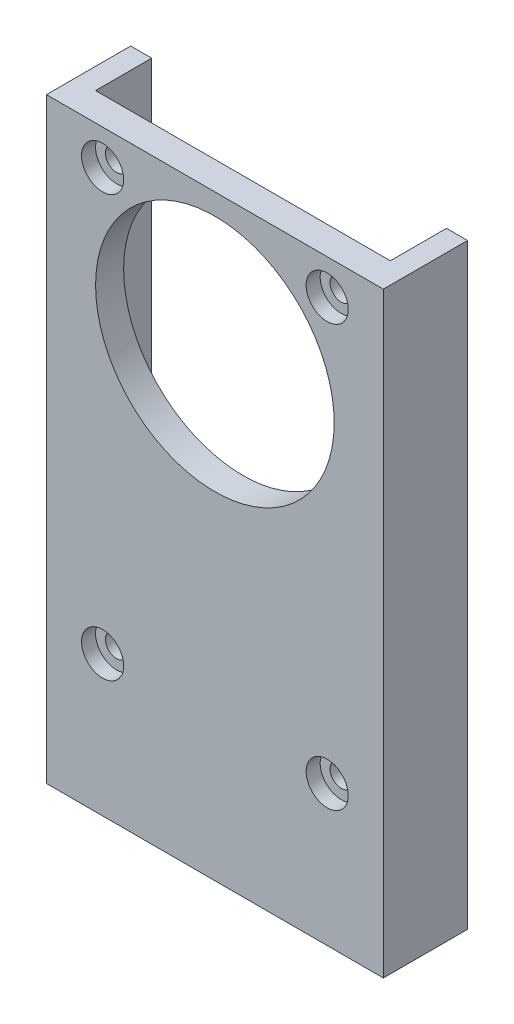
ISO-10303-21;
HEADER;
FILE_DESCRIPTION(('STEP AP214'),'2;1');
FILE_NAME('part.step','',(''),(''),'','','');
FILE_SCHEMA(('AUTOMOTIVE_DESIGN { 1 0 10303 214 1 1 1 1 }'));
ENDSEC;
DATA;
#1=APPLICATION_CONTEXT('core data for automotive mechanical design processes');
#2=APPLICATION_PROTOCOL_DEFINITION('international standard','automotive_design',2000,#1);
#3=PRODUCT_CONTEXT('',#1,'mechanical');
#4=PRODUCT('Part','Part','',(#3));
#5=PRODUCT_RELATED_PRODUCT_CATEGORY('part','',(#4));
#6=PRODUCT_DEFINITION_FORMATION('','',#4);
#7=PRODUCT_DEFINITION_CONTEXT('part definition',#1,'design');
#8=PRODUCT_DEFINITION('design','',#6,#7);
#9=PRODUCT_DEFINITION_SHAPE('','',#8);
#10=(LENGTH_UNIT() NAMED_UNIT(*) SI_UNIT(.MILLI.,.METRE.));
#11=(NAMED_UNIT(*) PLANE_ANGLE_UNIT() SI_UNIT($,.RADIAN.));
#12=(NAMED_UNIT(*) SI_UNIT($,.STERADIAN.) SOLID_ANGLE_UNIT());
#13=UNCERTAINTY_MEASURE_WITH_UNIT(LENGTH_MEASURE(1.E-05),#10,'distance_accuracy_value','');
#14=(GEOMETRIC_REPRESENTATION_CONTEXT(3) GLOBAL_UNCERTAINTY_ASSIGNED_CONTEXT((#13)) GLOBAL_UNIT_ASSIGNED_CONTEXT((#10,
#11,#12)) REPRESENTATION_CONTEXT('',''));
#15=CARTESIAN_POINT('',(0.,0.,0.));
#16=DIRECTION('',(0.,0.,1.));
#17=DIRECTION('',(1.,0.,0.));
#18=AXIS2_PLACEMENT_3D('',#15,#16,#17);
#19=CARTESIAN_POINT('',(8.00000000000002,-15.,2.));
#20=DIRECTION('',(0.,0.,-1.));
#21=DIRECTION('',(-1.,0.,0.));
#22=AXIS2_PLACEMENT_3D('',#19,#20,#21);
#23=CYLINDRICAL_SURFACE('',#22,0.800000000000001);
#24=CARTESIAN_POINT('',(8.00000000000002,-15.,0.));
#25=DIRECTION('',(0.,0.,1.));
#26=DIRECTION('',(1.,0.,0.));
#27=AXIS2_PLACEMENT_3D('',#24,#25,#26);
#28=CIRCLE('',#27,0.800000000000001);
#29=CARTESIAN_POINT('',(8.80000000000002,-15.,0.));
#30=VERTEX_POINT('',#29);
#31=EDGE_CURVE('E391',#30,#30,#28,.T.);
#32=ORIENTED_EDGE('',*,*,#31,.F.);
#33=EDGE_LOOP('',(#32));
#34=FACE_BOUND('',#33,.T.);
#35=CARTESIAN_POINT('',(8.00000000000002,-15.,1.));
#36=DIRECTION('',(0.,0.,1.));
#37=DIRECTION('',(1.,0.,0.));
#38=AXIS2_PLACEMENT_3D('',#35,#36,#37);
#39=CIRCLE('',#38,0.800000000000001);
#40=CARTESIAN_POINT('',(8.80000000000002,-15.,1.));
#41=VERTEX_POINT('',#40);
#42=EDGE_CURVE('E51',#41,#41,#39,.T.);
#43=ORIENTED_EDGE('',*,*,#42,.T.);
#44=EDGE_LOOP('',(#43));
#45=FACE_BOUND('',#44,.T.);
#46=ADVANCED_FACE('F47',(#34,#45),#23,.F.);
#47=CARTESIAN_POINT('',(8.00000000000001,15.,2.));
#48=DIRECTION('',(0.,0.,-1.));
#49=DIRECTION('',(-1.,0.,0.));
#50=AXIS2_PLACEMENT_3D('',#47,#48,#49);
#51=CYLINDRICAL_SURFACE('',#50,0.800000000000001);
#52=CARTESIAN_POINT('',(8.00000000000001,15.,0.));
#53=DIRECTION('',(0.,0.,1.));
#54=DIRECTION('',(1.,0.,0.));
#55=AXIS2_PLACEMENT_3D('',#52,#53,#54);
#56=CIRCLE('',#55,0.800000000000001);
#57=CARTESIAN_POINT('',(8.80000000000001,15.,0.));
#58=VERTEX_POINT('',#57);
#59=EDGE_CURVE('E372',#58,#58,#56,.F.);
#60=ORIENTED_EDGE('',*,*,#59,.T.);
#61=EDGE_LOOP('',(#60));
#62=FACE_BOUND('',#61,.T.);
#63=CARTESIAN_POINT('',(8.00000000000001,15.,1.));
#64=DIRECTION('',(0.,0.,1.));
#65=DIRECTION('',(1.,0.,0.));
#66=AXIS2_PLACEMENT_3D('',#63,#64,#65);
#67=CIRCLE('',#66,0.800000000000001);
#68=CARTESIAN_POINT('',(8.80000000000001,15.,1.));
#69=VERTEX_POINT('',#68);
#70=EDGE_CURVE('E402',#69,#69,#67,.F.);
#71=ORIENTED_EDGE('',*,*,#70,.F.);
#72=EDGE_LOOP('',(#71));
#73=FACE_BOUND('',#72,.T.);
#74=ADVANCED_FACE('F510',(#62,#73),#51,.F.);
#75=CARTESIAN_POINT('',(0.,-25.,-2.75));
#76=DIRECTION('',(0.,1.,0.));
#77=DIRECTION('',(0.,0.,1.));
#78=AXIS2_PLACEMENT_3D('',#75,#76,#77);
#79=CYLINDRICAL_SURFACE('',#78,1.);
#80=CARTESIAN_POINT('',(0.,-25.,-2.75));
#81=DIRECTION('',(0.,1.,0.));
#82=DIRECTION('',(0.,0.,1.));
#83=AXIS2_PLACEMENT_3D('',#80,#81,#82);
#84=CIRCLE('',#83,1.);
#85=CARTESIAN_POINT('',(0.,-25.,-1.75));
#86=VERTEX_POINT('',#85);
#87=EDGE_CURVE('E302',#86,#86,#84,.T.);
#88=ORIENTED_EDGE('',*,*,#87,.F.);
#89=EDGE_LOOP('',(#88));
#90=FACE_BOUND('',#89,.T.);
#91=CARTESIAN_POINT('',(0.,-24.,-2.75));
#92=DIRECTION('',(0.,1.,0.));
#93=DIRECTION('',(0.,0.,1.));
#94=AXIS2_PLACEMENT_3D('',#91,#92,#93);
#95=CIRCLE('',#94,1.);
#96=CARTESIAN_POINT('',(0.,-24.,-1.75));
#97=VERTEX_POINT('',#96);
#98=EDGE_CURVE('E248',#97,#97,#95,.T.);
#99=ORIENTED_EDGE('',*,*,#98,.T.);
#100=EDGE_LOOP('',(#99));
#101=FACE_BOUND('',#100,.T.);
#102=ADVANCED_FACE('F517',(#90,#101),#79,.F.);
#103=CARTESIAN_POINT('',(0.,0.,0.));
#104=DIRECTION('',(0.,0.,1.));
#105=DIRECTION('',(1.,0.,0.));
#106=AXIS2_PLACEMENT_3D('',#103,#104,#105);
#107=PLANE('',#106);
#108=CARTESIAN_POINT('',(-8.,-15.,0.));
#109=DIRECTION('',(0.,0.,1.));
#110=DIRECTION('',(1.,0.,0.));
#111=AXIS2_PLACEMENT_3D('',#108,#109,#110);
#112=CIRCLE('',#111,0.800000000000001);
#113=CARTESIAN_POINT('',(-7.2,-15.,0.));
#114=VERTEX_POINT('',#113);
#115=EDGE_CURVE('E366',#114,#114,#112,.F.);
#116=ORIENTED_EDGE('',*,*,#115,.F.);
#117=EDGE_LOOP('',(#116));
#118=FACE_BOUND('',#117,.T.);
#119=ORIENTED_EDGE('',*,*,#31,.T.);
#120=EDGE_LOOP('',(#119));
#121=FACE_BOUND('',#120,.T.);
#122=CARTESIAN_POINT('',(-8.,15.,0.));
#123=DIRECTION('',(0.,0.,1.));
#124=DIRECTION('',(1.,0.,0.));
#125=AXIS2_PLACEMENT_3D('',#122,#123,#124);
#126=CIRCLE('',#125,0.800000000000001);
#127=CARTESIAN_POINT('',(-7.2,15.,0.));
#128=VERTEX_POINT('',#127);
#129=EDGE_CURVE('E376',#128,#128,#126,.T.);
#130=ORIENTED_EDGE('',*,*,#129,.T.);
#131=EDGE_LOOP('',(#130));
#132=FACE_BOUND('',#131,.T.);
#133=ORIENTED_EDGE('',*,*,#59,.F.);
#134=EDGE_LOOP('',(#133));
#135=FACE_BOUND('',#134,.T.);
#136=CARTESIAN_POINT('',(0.,7.5,0.));
#137=DIRECTION('',(0.,0.,1.));
#138=DIRECTION('',(1.,0.,0.));
#139=AXIS2_PLACEMENT_3D('',#136,#137,#138);
#140=CIRCLE('',#139,8.5);
#141=CARTESIAN_POINT('',(8.5,7.5,0.));
#142=VERTEX_POINT('',#141);
#143=EDGE_CURVE('E361',#142,#142,#140,.T.);
#144=ORIENTED_EDGE('',*,*,#143,.T.);
#145=EDGE_LOOP('',(#144));
#146=FACE_BOUND('',#145,.T.);
#147=DIRECTION('',(0.,1.,0.));
#148=VECTOR('',#147,1.);
#149=CARTESIAN_POINT('',(-5.00000000000002,0.,0.));
#150=LINE('',#149,#148);
#151=CARTESIAN_POINT('',(-5.,-25.,0.));
#152=VERTEX_POINT('',#151);
#153=CARTESIAN_POINT('',(-5.,-23.,0.));
#154=VERTEX_POINT('',#153);
#155=EDGE_CURVE('E350',#152,#154,#150,.T.);
#156=ORIENTED_EDGE('',*,*,#155,.F.);
#157=DIRECTION('',(-1.,0.,0.));
#158=VECTOR('',#157,1.);
#159=CARTESIAN_POINT('',(0.,-25.,0.));
#160=LINE('',#159,#158);
#161=CARTESIAN_POINT('',(-10.5,-25.,0.));
#162=VERTEX_POINT('',#161);
#163=EDGE_CURVE('E356',#152,#162,#160,.T.);
#164=ORIENTED_EDGE('',*,*,#163,.T.);
#165=DIRECTION('',(0.,1.,0.));
#166=VECTOR('',#165,1.);
#167=CARTESIAN_POINT('',(-10.5,0.,0.));
#168=LINE('',#167,#166);
#169=CARTESIAN_POINT('',(-10.5,17.5,0.));
#170=VERTEX_POINT('',#169);
#171=EDGE_CURVE('E387',#162,#170,#168,.T.);
#172=ORIENTED_EDGE('',*,*,#171,.T.);
#173=DIRECTION('',(1.,0.,0.));
#174=VECTOR('',#173,1.);
#175=CARTESIAN_POINT('',(0.,17.5,0.));
#176=LINE('',#175,#174);
#177=CARTESIAN_POINT('',(10.5,17.5,0.));
#178=VERTEX_POINT('',#177);
#179=EDGE_CURVE('E384',#170,#178,#176,.T.);
#180=ORIENTED_EDGE('',*,*,#179,.T.);
#181=DIRECTION('',(0.,1.,0.));
#182=VECTOR('',#181,1.);
#183=CARTESIAN_POINT('',(10.5,0.,0.));
#184=LINE('',#183,#182);
#185=CARTESIAN_POINT('',(10.5,-25.,0.));
#186=VERTEX_POINT('',#185);
#187=EDGE_CURVE('E380',#186,#178,#184,.T.);
#188=ORIENTED_EDGE('',*,*,#187,.F.);
#189=CARTESIAN_POINT('',(5.,-25.,0.));
#190=VERTEX_POINT('',#189);
#191=EDGE_CURVE('E357',#186,#190,#160,.T.);
#192=ORIENTED_EDGE('',*,*,#191,.T.);
#193=DIRECTION('',(0.,1.,0.));
#194=VECTOR('',#193,1.);
#195=CARTESIAN_POINT('',(5.,0.,0.));
#196=LINE('',#195,#194);
#197=CARTESIAN_POINT('',(5.,-23.,0.));
#198=VERTEX_POINT('',#197);
#199=EDGE_CURVE('E337',#190,#198,#196,.T.);
#200=ORIENTED_EDGE('',*,*,#199,.T.);
#201=DIRECTION('',(1.,0.,0.));
#202=VECTOR('',#201,1.);
#203=CARTESIAN_POINT('',(0.,-23.,0.));
#204=LINE('',#203,#202);
#205=EDGE_CURVE('E11',#154,#198,#204,.T.);
#206=ORIENTED_EDGE('',*,*,#205,.F.);
#207=EDGE_LOOP('',(#156,#164,#172,#180,#188,#192,#200,#206));
#208=FACE_BOUND('',#207,.T.);
#209=ADVANCED_FACE('F484',(#118,#121,#132,#135,#146,#208),#107,.F.);
#210=CARTESIAN_POINT('',(0.,17.5,2.));
#211=DIRECTION('',(0.,1.,0.));
#212=DIRECTION('',(0.,0.,1.));
#213=AXIS2_PLACEMENT_3D('',#210,#211,#212);
#214=PLANE('',#213);
#215=ORIENTED_EDGE('',*,*,#179,.F.);
#216=DIRECTION('',(0.,0.,1.));
#217=VECTOR('',#216,1.);
#218=CARTESIAN_POINT('',(-10.5,17.5,0.));
#219=LINE('',#218,#217);
#220=CARTESIAN_POINT('',(-10.5,17.5,-4.));
#221=VERTEX_POINT('',#220);
#222=EDGE_CURVE('E221',#221,#170,#219,.T.);
#223=ORIENTED_EDGE('',*,*,#222,.F.);
#224=DIRECTION('',(1.,0.,0.));
#225=VECTOR('',#224,1.);
#226=CARTESIAN_POINT('',(0.,17.5,-4.));
#227=LINE('',#226,#225);
#228=CARTESIAN_POINT('',(-12.,17.5,-4.));
#229=VERTEX_POINT('',#228);
#230=EDGE_CURVE('E222',#229,#221,#227,.T.);
#231=ORIENTED_EDGE('',*,*,#230,.F.);
#232=DIRECTION('',(0.,0.,1.));
#233=VECTOR('',#232,1.);
#234=CARTESIAN_POINT('',(-12.,17.5,0.));
#235=LINE('',#234,#233);
#236=CARTESIAN_POINT('',(-12.,17.5,2.));
#237=VERTEX_POINT('',#236);
#238=EDGE_CURVE('E216',#229,#237,#235,.T.);
#239=ORIENTED_EDGE('',*,*,#238,.T.);
#240=DIRECTION('',(1.,0.,0.));
#241=VECTOR('',#240,1.);
#242=CARTESIAN_POINT('',(0.,17.5,2.));
#243=LINE('',#242,#241);
#244=CARTESIAN_POINT('',(12.,17.5,2.));
#245=VERTEX_POINT('',#244);
#246=EDGE_CURVE('E57',#237,#245,#243,.T.);
#247=ORIENTED_EDGE('',*,*,#246,.T.);
#248=DIRECTION('',(0.,0.,1.));
#249=VECTOR('',#248,1.);
#250=CARTESIAN_POINT('',(12.,17.5,0.));
#251=LINE('',#250,#249);
#252=CARTESIAN_POINT('',(12.,17.5,-4.));
#253=VERTEX_POINT('',#252);
#254=EDGE_CURVE('E186',#253,#245,#251,.T.);
#255=ORIENTED_EDGE('',*,*,#254,.F.);
#256=DIRECTION('',(-1.,0.,0.));
#257=VECTOR('',#256,1.);
#258=CARTESIAN_POINT('',(0.,17.5,-4.));
#259=LINE('',#258,#257);
#260=CARTESIAN_POINT('',(10.5,17.5,-4.));
#261=VERTEX_POINT('',#260);
#262=EDGE_CURVE('E181',#253,#261,#259,.T.);
#263=ORIENTED_EDGE('',*,*,#262,.T.);
#264=DIRECTION('',(0.,0.,1.));
#265=VECTOR('',#264,1.);
#266=CARTESIAN_POINT('',(10.5,17.5,0.));
#267=LINE('',#266,#265);
#268=EDGE_CURVE('E198',#261,#178,#267,.T.);
#269=ORIENTED_EDGE('',*,*,#268,.T.);
#270=EDGE_LOOP('',(#215,#223,#231,#239,#247,#255,#263,#269));
#271=FACE_BOUND('',#270,.T.);
#272=ADVANCED_FACE('F463',(#271),#214,.T.);
#273=CARTESIAN_POINT('',(-8.,15.,2.));
#274=DIRECTION('',(0.,0.,-1.));
#275=DIRECTION('',(-1.,0.,0.));
#276=AXIS2_PLACEMENT_3D('',#273,#274,#275);
#277=CYLINDRICAL_SURFACE('',#276,0.800000000000001);
#278=CARTESIAN_POINT('',(-8.,15.,1.));
#279=DIRECTION('',(0.,0.,-1.));
#280=DIRECTION('',(-1.,0.,0.));
#281=AXIS2_PLACEMENT_3D('',#278,#279,#280);
#282=CIRCLE('',#281,0.800000000000001);
#283=CARTESIAN_POINT('',(-8.8,15.,1.));
#284=VERTEX_POINT('',#283);
#285=EDGE_CURVE('E406',#284,#284,#282,.T.);
#286=ORIENTED_EDGE('',*,*,#285,.F.);
#287=EDGE_LOOP('',(#286));
#288=FACE_BOUND('',#287,.T.);
#289=ORIENTED_EDGE('',*,*,#129,.F.);
#290=EDGE_LOOP('',(#289));
#291=FACE_BOUND('',#290,.T.);
#292=ADVANCED_FACE('F526',(#288,#291),#277,.F.);
#293=CARTESIAN_POINT('',(0.,7.5,2.));
#294=DIRECTION('',(0.,0.,-1.));
#295=DIRECTION('',(-1.,0.,0.));
#296=AXIS2_PLACEMENT_3D('',#293,#294,#295);
#297=CYLINDRICAL_SURFACE('',#296,8.5);
#298=CARTESIAN_POINT('',(0.,7.5,2.));
#299=DIRECTION('',(0.,0.,1.));
#300=DIRECTION('',(1.,0.,0.));
#301=AXIS2_PLACEMENT_3D('',#298,#299,#300);
#302=CIRCLE('',#301,8.5);
#303=CARTESIAN_POINT('',(8.5,7.5,2.));
#304=VERTEX_POINT('',#303);
#305=EDGE_CURVE('E362',#304,#304,#302,.T.);
#306=ORIENTED_EDGE('',*,*,#305,.T.);
#307=EDGE_LOOP('',(#306));
#308=FACE_BOUND('',#307,.T.);
#309=ORIENTED_EDGE('',*,*,#143,.F.);
#310=EDGE_LOOP('',(#309));
#311=FACE_BOUND('',#310,.T.);
#312=ADVANCED_FACE('F49',(#308,#311),#297,.F.);
#313=CARTESIAN_POINT('',(-8.,-15.,2.));
#314=DIRECTION('',(0.,0.,-1.));
#315=DIRECTION('',(-1.,0.,0.));
#316=AXIS2_PLACEMENT_3D('',#313,#314,#315);
#317=CYLINDRICAL_SURFACE('',#316,0.800000000000001);
#318=CARTESIAN_POINT('',(-8.,-15.,1.));
#319=DIRECTION('',(0.,0.,-1.));
#320=DIRECTION('',(-1.,0.,0.));
#321=AXIS2_PLACEMENT_3D('',#318,#319,#320);
#322=CIRCLE('',#321,0.800000000000001);
#323=CARTESIAN_POINT('',(-8.8,-15.,1.));
#324=VERTEX_POINT('',#323);
#325=EDGE_CURVE('E398',#324,#324,#322,.F.);
#326=ORIENTED_EDGE('',*,*,#325,.T.);
#327=EDGE_LOOP('',(#326));
#328=FACE_BOUND('',#327,.T.);
#329=ORIENTED_EDGE('',*,*,#115,.T.);
#330=EDGE_LOOP('',(#329));
#331=FACE_BOUND('',#330,.T.);
#332=ADVANCED_FACE('F522',(#328,#331),#317,.F.);
#333=CARTESIAN_POINT('',(0.,0.,2.));
#334=DIRECTION('',(0.,0.,1.));
#335=DIRECTION('',(1.,0.,0.));
#336=AXIS2_PLACEMENT_3D('',#333,#334,#335);
#337=PLANE('',#336);
#338=CARTESIAN_POINT('',(-8.00000000000001,15.,2.));
#339=DIRECTION('',(0.,0.,1.));
#340=DIRECTION('',(-1.,0.,0.));
#341=AXIS2_PLACEMENT_3D('',#338,#339,#340);
#342=CIRCLE('',#341,1.5);
#343=CARTESIAN_POINT('',(-9.50000000000001,15.,2.));
#344=VERTEX_POINT('',#343);
#345=EDGE_CURVE('E442',#344,#344,#342,.T.);
#346=ORIENTED_EDGE('',*,*,#345,.F.);
#347=EDGE_LOOP('',(#346));
#348=FACE_BOUND('',#347,.T.);
#349=CARTESIAN_POINT('',(-8.00000000000002,-15.,2.));
#350=DIRECTION('',(0.,0.,1.));
#351=DIRECTION('',(-1.,0.,0.));
#352=AXIS2_PLACEMENT_3D('',#349,#350,#351);
#353=CIRCLE('',#352,1.5);
#354=CARTESIAN_POINT('',(-9.50000000000002,-15.,2.));
#355=VERTEX_POINT('',#354);
#356=EDGE_CURVE('E428',#355,#355,#353,.T.);
#357=ORIENTED_EDGE('',*,*,#356,.F.);
#358=EDGE_LOOP('',(#357));
#359=FACE_BOUND('',#358,.T.);
#360=CARTESIAN_POINT('',(8.00000000000002,-15.,2.));
#361=DIRECTION('',(0.,0.,1.));
#362=DIRECTION('',(1.,0.,0.));
#363=AXIS2_PLACEMENT_3D('',#360,#361,#362);
#364=CIRCLE('',#363,1.5);
#365=CARTESIAN_POINT('',(9.50000000000002,-15.,2.));
#366=VERTEX_POINT('',#365);
#367=EDGE_CURVE('E427',#366,#366,#364,.T.);
#368=ORIENTED_EDGE('',*,*,#367,.F.);
#369=EDGE_LOOP('',(#368));
#370=FACE_BOUND('',#369,.T.);
#371=CARTESIAN_POINT('',(8.00000000000001,15.,2.));
#372=DIRECTION('',(0.,0.,1.));
#373=DIRECTION('',(1.,0.,0.));
#374=AXIS2_PLACEMENT_3D('',#371,#372,#373);
#375=CIRCLE('',#374,1.5);
#376=CARTESIAN_POINT('',(9.50000000000001,15.,2.));
#377=VERTEX_POINT('',#376);
#378=EDGE_CURVE('E433',#377,#377,#375,.T.);
#379=ORIENTED_EDGE('',*,*,#378,.F.);
#380=EDGE_LOOP('',(#379));
#381=FACE_BOUND('',#380,.T.);
#382=DIRECTION('',(1.,0.,0.));
#383=VECTOR('',#382,1.);
#384=CARTESIAN_POINT('',(0.,-25.,2.));
#385=LINE('',#384,#383);
#386=CARTESIAN_POINT('',(-12.,-25.,2.));
#387=VERTEX_POINT('',#386);
#388=CARTESIAN_POINT('',(12.,-25.,2.));
#389=VERTEX_POINT('',#388);
#390=EDGE_CURVE('E353',#387,#389,#385,.T.);
#391=ORIENTED_EDGE('',*,*,#390,.T.);
#392=DIRECTION('',(0.,1.,0.));
#393=VECTOR('',#392,1.);
#394=CARTESIAN_POINT('',(12.,-31.1846584384265,2.));
#395=LINE('',#394,#393);
#396=EDGE_CURVE('E194',#389,#245,#395,.T.);
#397=ORIENTED_EDGE('',*,*,#396,.T.);
#398=ORIENTED_EDGE('',*,*,#246,.F.);
#399=DIRECTION('',(0.,1.,0.));
#400=VECTOR('',#399,1.);
#401=CARTESIAN_POINT('',(-12.,-31.1846584384265,2.));
#402=LINE('',#401,#400);
#403=EDGE_CURVE('E237',#387,#237,#402,.T.);
#404=ORIENTED_EDGE('',*,*,#403,.F.);
#405=EDGE_LOOP('',(#391,#397,#398,#404));
#406=FACE_BOUND('',#405,.T.);
#407=ORIENTED_EDGE('',*,*,#305,.F.);
#408=EDGE_LOOP('',(#407));
#409=FACE_BOUND('',#408,.T.);
#410=ADVANCED_FACE('F468',(#348,#359,#370,#381,#406,#409),#337,.T.);
#411=CARTESIAN_POINT('',(0.,-25.,-22.2991031209778));
#412=DIRECTION('',(0.,-1.,0.));
#413=DIRECTION('',(1.,0.,0.));
#414=AXIS2_PLACEMENT_3D('',#411,#412,#413);
#415=PLANE('',#414);
#416=ORIENTED_EDGE('',*,*,#87,.T.);
#417=EDGE_LOOP('',(#416));
#418=FACE_BOUND('',#417,.T.);
#419=ORIENTED_EDGE('',*,*,#191,.F.);
#420=DIRECTION('',(0.,0.,1.));
#421=VECTOR('',#420,1.);
#422=CARTESIAN_POINT('',(10.5,-25.,0.));
#423=LINE('',#422,#421);
#424=CARTESIAN_POINT('',(10.5,-25.,-4.));
#425=VERTEX_POINT('',#424);
#426=EDGE_CURVE('E204',#425,#186,#423,.T.);
#427=ORIENTED_EDGE('',*,*,#426,.F.);
#428=DIRECTION('',(-1.,0.,0.));
#429=VECTOR('',#428,1.);
#430=CARTESIAN_POINT('',(0.,-25.,-4.));
#431=LINE('',#430,#429);
#432=CARTESIAN_POINT('',(12.,-25.,-4.));
#433=VERTEX_POINT('',#432);
#434=EDGE_CURVE('E178',#433,#425,#431,.T.);
#435=ORIENTED_EDGE('',*,*,#434,.F.);
#436=DIRECTION('',(0.,0.,1.));
#437=VECTOR('',#436,1.);
#438=CARTESIAN_POINT('',(12.,-25.,0.));
#439=LINE('',#438,#437);
#440=EDGE_CURVE('E191',#433,#389,#439,.T.);
#441=ORIENTED_EDGE('',*,*,#440,.T.);
#442=ORIENTED_EDGE('',*,*,#390,.F.);
#443=DIRECTION('',(0.,0.,1.));
#444=VECTOR('',#443,1.);
#445=CARTESIAN_POINT('',(-12.,-25.,0.));
#446=LINE('',#445,#444);
#447=CARTESIAN_POINT('',(-12.,-25.,-4.));
#448=VERTEX_POINT('',#447);
#449=EDGE_CURVE('E197',#448,#387,#446,.T.);
#450=ORIENTED_EDGE('',*,*,#449,.F.);
#451=DIRECTION('',(1.,0.,0.));
#452=VECTOR('',#451,1.);
#453=CARTESIAN_POINT('',(0.,-25.,-4.));
#454=LINE('',#453,#452);
#455=CARTESIAN_POINT('',(-10.5,-25.,-4.));
#456=VERTEX_POINT('',#455);
#457=EDGE_CURVE('E230',#448,#456,#454,.T.);
#458=ORIENTED_EDGE('',*,*,#457,.T.);
#459=DIRECTION('',(0.,0.,1.));
#460=VECTOR('',#459,1.);
#461=CARTESIAN_POINT('',(-10.5,-25.,0.));
#462=LINE('',#461,#460);
#463=EDGE_CURVE('E220',#456,#162,#462,.T.);
#464=ORIENTED_EDGE('',*,*,#463,.T.);
#465=ORIENTED_EDGE('',*,*,#163,.F.);
#466=DIRECTION('',(0.,0.,1.));
#467=VECTOR('',#466,1.);
#468=CARTESIAN_POINT('',(-5.,-25.,-5.5));
#469=LINE('',#468,#467);
#470=CARTESIAN_POINT('',(-5.,-25.,-5.5));
#471=VERTEX_POINT('',#470);
#472=EDGE_CURVE('E334',#471,#152,#469,.T.);
#473=ORIENTED_EDGE('',*,*,#472,.F.);
#474=DIRECTION('',(1.,0.,0.));
#475=VECTOR('',#474,1.);
#476=CARTESIAN_POINT('',(0.,-25.,-5.5));
#477=LINE('',#476,#475);
#478=CARTESIAN_POINT('',(5.,-25.,-5.5));
#479=VERTEX_POINT('',#478);
#480=EDGE_CURVE('E320',#471,#479,#477,.T.);
#481=ORIENTED_EDGE('',*,*,#480,.T.);
#482=DIRECTION('',(0.,0.,1.));
#483=VECTOR('',#482,1.);
#484=CARTESIAN_POINT('',(5.,-25.,-5.5));
#485=LINE('',#484,#483);
#486=EDGE_CURVE('E333',#479,#190,#485,.T.);
#487=ORIENTED_EDGE('',*,*,#486,.T.);
#488=EDGE_LOOP('',(#419,#427,#435,#441,#442,#450,#458,#464,#465,#473,#481,#487));
#489=FACE_BOUND('',#488,.T.);
#490=ADVANCED_FACE('F202',(#418,#489),#415,.T.);
#491=CARTESIAN_POINT('',(0.,-23.,-5.5));
#492=DIRECTION('',(0.,-1.,0.));
#493=DIRECTION('',(0.,0.,-1.));
#494=AXIS2_PLACEMENT_3D('',#491,#492,#493);
#495=PLANE('',#494);
#496=DIRECTION('',(0.499999999999999,0.,-0.866025403784439));
#497=VECTOR('',#496,1.);
#498=CARTESIAN_POINT('',(0.541265877365276,-23.,0.3125));
#499=LINE('',#498,#497);
#500=CARTESIAN_POINT('',(1.15470053837925,-23.,-0.749999999999999));
#501=VERTEX_POINT('',#500);
#502=CARTESIAN_POINT('',(2.3094010767585,-23.,-2.75));
#503=VERTEX_POINT('',#502);
#504=EDGE_CURVE('E280',#501,#503,#499,.T.);
#505=ORIENTED_EDGE('',*,*,#504,.F.);
#506=DIRECTION('',(1.,0.,0.));
#507=VECTOR('',#506,1.);
#508=CARTESIAN_POINT('',(0.,-23.,-0.75));
#509=LINE('',#508,#507);
#510=CARTESIAN_POINT('',(-1.15470053837925,-23.,-0.749999999999999));
#511=VERTEX_POINT('',#510);
#512=EDGE_CURVE('E65',#511,#501,#509,.T.);
#513=ORIENTED_EDGE('',*,*,#512,.F.);
#514=DIRECTION('',(0.5,0.,0.866025403784438));
#515=VECTOR('',#514,1.);
#516=CARTESIAN_POINT('',(-0.541265877365273,-23.,0.312499999999999));
#517=LINE('',#516,#515);
#518=CARTESIAN_POINT('',(-2.3094010767585,-23.,-2.75));
#519=VERTEX_POINT('',#518);
#520=EDGE_CURVE('E253',#519,#511,#517,.T.);
#521=ORIENTED_EDGE('',*,*,#520,.F.);
#522=DIRECTION('',(-0.5,0.,0.866025403784439));
#523=VECTOR('',#522,1.);
#524=CARTESIAN_POINT('',(-2.92283573777248,-23.,-1.6875));
#525=LINE('',#524,#523);
#526=CARTESIAN_POINT('',(-1.15470053837925,-23.,-4.75));
#527=VERTEX_POINT('',#526);
#528=EDGE_CURVE('E292',#527,#519,#525,.T.);
#529=ORIENTED_EDGE('',*,*,#528,.F.);
#530=DIRECTION('',(-1.,0.,0.));
#531=VECTOR('',#530,1.);
#532=CARTESIAN_POINT('',(0.,-23.,-4.75));
#533=LINE('',#532,#531);
#534=CARTESIAN_POINT('',(1.15470053837925,-23.,-4.75));
#535=VERTEX_POINT('',#534);
#536=EDGE_CURVE('E288',#535,#527,#533,.T.);
#537=ORIENTED_EDGE('',*,*,#536,.F.);
#538=DIRECTION('',(-0.5,0.,-0.866025403784439));
#539=VECTOR('',#538,1.);
#540=CARTESIAN_POINT('',(2.92283573777248,-23.,-1.6875));
#541=LINE('',#540,#539);
#542=EDGE_CURVE('E284',#503,#535,#541,.T.);
#543=ORIENTED_EDGE('',*,*,#542,.F.);
#544=EDGE_LOOP('',(#505,#513,#521,#529,#537,#543));
#545=FACE_BOUND('',#544,.T.);
#546=DIRECTION('',(0.,0.,1.));
#547=VECTOR('',#546,1.);
#548=CARTESIAN_POINT('',(-5.,-23.,-5.5));
#549=LINE('',#548,#547);
#550=CARTESIAN_POINT('',(-5.,-23.,-5.5));
#551=VERTEX_POINT('',#550);
#552=EDGE_CURVE('E338',#551,#154,#549,.T.);
#553=ORIENTED_EDGE('',*,*,#552,.T.);
#554=ORIENTED_EDGE('',*,*,#205,.T.);
#555=DIRECTION('',(0.,0.,1.));
#556=VECTOR('',#555,1.);
#557=CARTESIAN_POINT('',(5.,-23.,-5.5));
#558=LINE('',#557,#556);
#559=CARTESIAN_POINT('',(5.,-23.,-5.5));
#560=VERTEX_POINT('',#559);
#561=EDGE_CURVE('E73',#560,#198,#558,.T.);
#562=ORIENTED_EDGE('',*,*,#561,.F.);
#563=DIRECTION('',(1.,0.,0.));
#564=VECTOR('',#563,1.);
#565=CARTESIAN_POINT('',(0.,-23.,-5.5));
#566=LINE('',#565,#564);
#567=EDGE_CURVE('E327',#551,#560,#566,.T.);
#568=ORIENTED_EDGE('',*,*,#567,.F.);
#569=EDGE_LOOP('',(#553,#554,#562,#568));
#570=FACE_BOUND('',#569,.T.);
#571=ADVANCED_FACE('F493',(#545,#570),#495,.F.);
#572=CARTESIAN_POINT('',(-5.00000000000002,0.,-5.5));
#573=DIRECTION('',(1.,0.,0.));
#574=DIRECTION('',(0.,1.,0.));
#575=AXIS2_PLACEMENT_3D('',#572,#573,#574);
#576=PLANE('',#575);
#577=ORIENTED_EDGE('',*,*,#472,.T.);
#578=ORIENTED_EDGE('',*,*,#155,.T.);
#579=ORIENTED_EDGE('',*,*,#552,.F.);
#580=DIRECTION('',(0.,1.,0.));
#581=VECTOR('',#580,1.);
#582=CARTESIAN_POINT('',(-5.00000000000002,0.,-5.5));
#583=LINE('',#582,#581);
#584=EDGE_CURVE('E330',#471,#551,#583,.T.);
#585=ORIENTED_EDGE('',*,*,#584,.F.);
#586=EDGE_LOOP('',(#577,#578,#579,#585));
#587=FACE_BOUND('',#586,.T.);
#588=ADVANCED_FACE('F489',(#587),#576,.F.);
#589=CARTESIAN_POINT('',(5.,0.,-5.5));
#590=DIRECTION('',(1.,0.,0.));
#591=DIRECTION('',(0.,0.,-1.));
#592=AXIS2_PLACEMENT_3D('',#589,#590,#591);
#593=PLANE('',#592);
#594=ORIENTED_EDGE('',*,*,#199,.F.);
#595=ORIENTED_EDGE('',*,*,#486,.F.);
#596=DIRECTION('',(0.,1.,0.));
#597=VECTOR('',#596,1.);
#598=CARTESIAN_POINT('',(5.,0.,-5.5));
#599=LINE('',#598,#597);
#600=EDGE_CURVE('E324',#479,#560,#599,.T.);
#601=ORIENTED_EDGE('',*,*,#600,.T.);
#602=ORIENTED_EDGE('',*,*,#561,.T.);
#603=EDGE_LOOP('',(#594,#595,#601,#602));
#604=FACE_BOUND('',#603,.T.);
#605=ADVANCED_FACE('F593',(#604),#593,.T.);
#606=CARTESIAN_POINT('',(0.,0.,-5.5));
#607=DIRECTION('',(0.,0.,1.));
#608=DIRECTION('',(1.,0.,0.));
#609=AXIS2_PLACEMENT_3D('',#606,#607,#608);
#610=PLANE('',#609);
#611=ORIENTED_EDGE('',*,*,#480,.F.);
#612=ORIENTED_EDGE('',*,*,#584,.T.);
#613=ORIENTED_EDGE('',*,*,#567,.T.);
#614=ORIENTED_EDGE('',*,*,#600,.F.);
#615=EDGE_LOOP('',(#611,#612,#613,#614));
#616=FACE_BOUND('',#615,.T.);
#617=ADVANCED_FACE('F497',(#616),#610,.F.);
#618=CARTESIAN_POINT('',(0.,-24.,-0.75));
#619=DIRECTION('',(0.,0.,1.));
#620=DIRECTION('',(1.,0.,0.));
#621=AXIS2_PLACEMENT_3D('',#618,#619,#620);
#622=PLANE('',#621);
#623=ORIENTED_EDGE('',*,*,#512,.T.);
#624=DIRECTION('',(0.,1.,0.));
#625=VECTOR('',#624,1.);
#626=CARTESIAN_POINT('',(1.15470053837925,-24.,-0.75));
#627=LINE('',#626,#625);
#628=CARTESIAN_POINT('',(1.15470053837925,-24.,-0.75));
#629=VERTEX_POINT('',#628);
#630=EDGE_CURVE('E277',#629,#501,#627,.T.);
#631=ORIENTED_EDGE('',*,*,#630,.F.);
#632=DIRECTION('',(1.,0.,0.));
#633=VECTOR('',#632,1.);
#634=CARTESIAN_POINT('',(0.,-24.,-0.75));
#635=LINE('',#634,#633);
#636=CARTESIAN_POINT('',(-1.15470053837925,-24.,-0.749999999999999));
#637=VERTEX_POINT('',#636);
#638=EDGE_CURVE('E252',#637,#629,#635,.T.);
#639=ORIENTED_EDGE('',*,*,#638,.F.);
#640=DIRECTION('',(0.,1.,0.));
#641=VECTOR('',#640,1.);
#642=CARTESIAN_POINT('',(-1.15470053837925,-24.,-0.749999999999999));
#643=LINE('',#642,#641);
#644=EDGE_CURVE('E299',#637,#511,#643,.T.);
#645=ORIENTED_EDGE('',*,*,#644,.T.);
#646=EDGE_LOOP('',(#623,#631,#639,#645));
#647=FACE_BOUND('',#646,.T.);
#648=ADVANCED_FACE('F603',(#647),#622,.F.);
#649=CARTESIAN_POINT('',(-0.541265877365273,-24.,0.312499999999999));
#650=DIRECTION('',(-0.866025403784438,0.,0.5));
#651=DIRECTION('',(0.5,0.,0.866025403784438));
#652=AXIS2_PLACEMENT_3D('',#649,#650,#651);
#653=PLANE('',#652);
#654=ORIENTED_EDGE('',*,*,#520,.T.);
#655=ORIENTED_EDGE('',*,*,#644,.F.);
#656=DIRECTION('',(0.5,0.,0.866025403784438));
#657=VECTOR('',#656,1.);
#658=CARTESIAN_POINT('',(-0.541265877365273,-24.,0.312499999999999));
#659=LINE('',#658,#657);
#660=CARTESIAN_POINT('',(-2.3094010767585,-24.,-2.75));
#661=VERTEX_POINT('',#660);
#662=EDGE_CURVE('E273',#661,#637,#659,.T.);
#663=ORIENTED_EDGE('',*,*,#662,.F.);
#664=DIRECTION('',(0.,1.,0.));
#665=VECTOR('',#664,1.);
#666=CARTESIAN_POINT('',(-2.3094010767585,-24.,-2.75));
#667=LINE('',#666,#665);
#668=EDGE_CURVE('E303',#661,#519,#667,.T.);
#669=ORIENTED_EDGE('',*,*,#668,.T.);
#670=EDGE_LOOP('',(#654,#655,#663,#669));
#671=FACE_BOUND('',#670,.T.);
#672=ADVANCED_FACE('F609',(#671),#653,.F.);
#673=CARTESIAN_POINT('',(-2.92283573777248,-24.,-1.6875));
#674=DIRECTION('',(-0.866025403784439,0.,-0.499999999999999));
#675=DIRECTION('',(-0.5,0.,0.866025403784439));
#676=AXIS2_PLACEMENT_3D('',#673,#674,#675);
#677=PLANE('',#676);
#678=ORIENTED_EDGE('',*,*,#528,.T.);
#679=ORIENTED_EDGE('',*,*,#668,.F.);
#680=DIRECTION('',(-0.5,0.,0.866025403784439));
#681=VECTOR('',#680,1.);
#682=CARTESIAN_POINT('',(-2.92283573777248,-24.,-1.6875));
#683=LINE('',#682,#681);
#684=CARTESIAN_POINT('',(-1.15470053837925,-24.,-4.75));
#685=VERTEX_POINT('',#684);
#686=EDGE_CURVE('E269',#685,#661,#683,.T.);
#687=ORIENTED_EDGE('',*,*,#686,.F.);
#688=DIRECTION('',(0.,1.,0.));
#689=VECTOR('',#688,1.);
#690=CARTESIAN_POINT('',(-1.15470053837925,-24.,-4.75));
#691=LINE('',#690,#689);
#692=EDGE_CURVE('E306',#685,#527,#691,.T.);
#693=ORIENTED_EDGE('',*,*,#692,.T.);
#694=EDGE_LOOP('',(#678,#679,#687,#693));
#695=FACE_BOUND('',#694,.T.);
#696=ADVANCED_FACE('F622',(#695),#677,.F.);
#697=CARTESIAN_POINT('',(0.,-24.,-4.75));
#698=DIRECTION('',(0.,0.,-1.));
#699=DIRECTION('',(-1.,0.,0.));
#700=AXIS2_PLACEMENT_3D('',#697,#698,#699);
#701=PLANE('',#700);
#702=ORIENTED_EDGE('',*,*,#536,.T.);
#703=ORIENTED_EDGE('',*,*,#692,.F.);
#704=DIRECTION('',(-1.,0.,0.));
#705=VECTOR('',#704,1.);
#706=CARTESIAN_POINT('',(0.,-24.,-4.75));
#707=LINE('',#706,#705);
#708=CARTESIAN_POINT('',(1.15470053837925,-24.,-4.75));
#709=VERTEX_POINT('',#708);
#710=EDGE_CURVE('E265',#709,#685,#707,.T.);
#711=ORIENTED_EDGE('',*,*,#710,.F.);
#712=DIRECTION('',(0.,1.,0.));
#713=VECTOR('',#712,1.);
#714=CARTESIAN_POINT('',(1.15470053837925,-24.,-4.75));
#715=LINE('',#714,#713);
#716=EDGE_CURVE('E309',#709,#535,#715,.T.);
#717=ORIENTED_EDGE('',*,*,#716,.T.);
#718=EDGE_LOOP('',(#702,#703,#711,#717));
#719=FACE_BOUND('',#718,.T.);
#720=ADVANCED_FACE('F618',(#719),#701,.F.);
#721=CARTESIAN_POINT('',(2.92283573777248,-24.,-1.6875));
#722=DIRECTION('',(0.866025403784439,0.,-0.5));
#723=DIRECTION('',(-0.5,0.,-0.866025403784439));
#724=AXIS2_PLACEMENT_3D('',#721,#722,#723);
#725=PLANE('',#724);
#726=ORIENTED_EDGE('',*,*,#542,.T.);
#727=ORIENTED_EDGE('',*,*,#716,.F.);
#728=DIRECTION('',(-0.5,0.,-0.866025403784439));
#729=VECTOR('',#728,1.);
#730=CARTESIAN_POINT('',(2.92283573777248,-24.,-1.6875));
#731=LINE('',#730,#729);
#732=CARTESIAN_POINT('',(2.3094010767585,-24.,-2.75));
#733=VERTEX_POINT('',#732);
#734=EDGE_CURVE('E261',#733,#709,#731,.T.);
#735=ORIENTED_EDGE('',*,*,#734,.F.);
#736=DIRECTION('',(0.,1.,0.));
#737=VECTOR('',#736,1.);
#738=CARTESIAN_POINT('',(2.3094010767585,-24.,-2.75));
#739=LINE('',#738,#737);
#740=EDGE_CURVE('E312',#733,#503,#739,.T.);
#741=ORIENTED_EDGE('',*,*,#740,.T.);
#742=EDGE_LOOP('',(#726,#727,#735,#741));
#743=FACE_BOUND('',#742,.T.);
#744=ADVANCED_FACE('F614',(#743),#725,.F.);
#745=CARTESIAN_POINT('',(0.541265877365276,-24.,0.3125));
#746=DIRECTION('',(0.866025403784439,0.,0.499999999999999));
#747=DIRECTION('',(0.499999999999999,0.,-0.866025403784439));
#748=AXIS2_PLACEMENT_3D('',#745,#746,#747);
#749=PLANE('',#748);
#750=ORIENTED_EDGE('',*,*,#504,.T.);
#751=ORIENTED_EDGE('',*,*,#740,.F.);
#752=DIRECTION('',(0.499999999999999,0.,-0.866025403784439));
#753=VECTOR('',#752,1.);
#754=CARTESIAN_POINT('',(0.541265877365276,-24.,0.3125));
#755=LINE('',#754,#753);
#756=EDGE_CURVE('E257',#629,#733,#755,.T.);
#757=ORIENTED_EDGE('',*,*,#756,.F.);
#758=ORIENTED_EDGE('',*,*,#630,.T.);
#759=EDGE_LOOP('',(#750,#751,#757,#758));
#760=FACE_BOUND('',#759,.T.);
#761=ADVANCED_FACE('F610',(#760),#749,.F.);
#762=CARTESIAN_POINT('',(0.,-24.,0.));
#763=DIRECTION('',(0.,1.,0.));
#764=DIRECTION('',(0.,0.,1.));
#765=AXIS2_PLACEMENT_3D('',#762,#763,#764);
#766=PLANE('',#765);
#767=ORIENTED_EDGE('',*,*,#98,.F.);
#768=EDGE_LOOP('',(#767));
#769=FACE_BOUND('',#768,.T.);
#770=ORIENTED_EDGE('',*,*,#638,.T.);
#771=ORIENTED_EDGE('',*,*,#756,.T.);
#772=ORIENTED_EDGE('',*,*,#734,.T.);
#773=ORIENTED_EDGE('',*,*,#710,.T.);
#774=ORIENTED_EDGE('',*,*,#686,.T.);
#775=ORIENTED_EDGE('',*,*,#662,.T.);
#776=EDGE_LOOP('',(#770,#771,#772,#773,#774,#775));
#777=FACE_BOUND('',#776,.T.);
#778=ADVANCED_FACE('F613',(#769,#777),#766,.T.);
#779=CARTESIAN_POINT('',(-12.,-31.1846584384265,0.));
#780=DIRECTION('',(-1.,0.,0.));
#781=DIRECTION('',(0.,0.,1.));
#782=AXIS2_PLACEMENT_3D('',#779,#780,#781);
#783=PLANE('',#782);
#784=DIRECTION('',(0.,1.,0.));
#785=VECTOR('',#784,1.);
#786=CARTESIAN_POINT('',(-12.,-31.1846584384265,-4.));
#787=LINE('',#786,#785);
#788=EDGE_CURVE('E227',#448,#229,#787,.T.);
#789=ORIENTED_EDGE('',*,*,#788,.F.);
#790=ORIENTED_EDGE('',*,*,#449,.T.);
#791=ORIENTED_EDGE('',*,*,#403,.T.);
#792=ORIENTED_EDGE('',*,*,#238,.F.);
#793=EDGE_LOOP('',(#789,#790,#791,#792));
#794=FACE_BOUND('',#793,.T.);
#795=ADVANCED_FACE('F473',(#794),#783,.T.);
#796=CARTESIAN_POINT('',(0.,-31.1846584384265,-4.));
#797=DIRECTION('',(0.,0.,1.));
#798=DIRECTION('',(1.,0.,0.));
#799=AXIS2_PLACEMENT_3D('',#796,#797,#798);
#800=PLANE('',#799);
#801=ORIENTED_EDGE('',*,*,#457,.F.);
#802=ORIENTED_EDGE('',*,*,#788,.T.);
#803=ORIENTED_EDGE('',*,*,#230,.T.);
#804=DIRECTION('',(0.,1.,0.));
#805=VECTOR('',#804,1.);
#806=CARTESIAN_POINT('',(-10.5,-31.1846584384265,-4.));
#807=LINE('',#806,#805);
#808=EDGE_CURVE('E226',#456,#221,#807,.T.);
#809=ORIENTED_EDGE('',*,*,#808,.F.);
#810=EDGE_LOOP('',(#801,#802,#803,#809));
#811=FACE_BOUND('',#810,.T.);
#812=ADVANCED_FACE('F475',(#811),#800,.F.);
#813=CARTESIAN_POINT('',(-10.5,-31.1846584384265,0.));
#814=DIRECTION('',(-1.,0.,0.));
#815=DIRECTION('',(0.,0.,1.));
#816=AXIS2_PLACEMENT_3D('',#813,#814,#815);
#817=PLANE('',#816);
#818=ORIENTED_EDGE('',*,*,#171,.F.);
#819=ORIENTED_EDGE('',*,*,#463,.F.);
#820=ORIENTED_EDGE('',*,*,#808,.T.);
#821=ORIENTED_EDGE('',*,*,#222,.T.);
#822=EDGE_LOOP('',(#818,#819,#820,#821));
#823=FACE_BOUND('',#822,.T.);
#824=ADVANCED_FACE('F478',(#823),#817,.F.);
#825=CARTESIAN_POINT('',(10.5,-31.1846584384265,0.));
#826=DIRECTION('',(-1.,0.,0.));
#827=DIRECTION('',(0.,0.,1.));
#828=AXIS2_PLACEMENT_3D('',#825,#826,#827);
#829=PLANE('',#828);
#830=ORIENTED_EDGE('',*,*,#426,.T.);
#831=ORIENTED_EDGE('',*,*,#187,.T.);
#832=ORIENTED_EDGE('',*,*,#268,.F.);
#833=DIRECTION('',(0.,1.,0.));
#834=VECTOR('',#833,1.);
#835=CARTESIAN_POINT('',(10.5,-31.1846584384265,-4.));
#836=LINE('',#835,#834);
#837=EDGE_CURVE('E187',#425,#261,#836,.T.);
#838=ORIENTED_EDGE('',*,*,#837,.F.);
#839=EDGE_LOOP('',(#830,#831,#832,#838));
#840=FACE_BOUND('',#839,.T.);
#841=ADVANCED_FACE('F499',(#840),#829,.T.);
#842=CARTESIAN_POINT('',(0.,-31.1846584384265,-4.));
#843=DIRECTION('',(0.,0.,-1.));
#844=DIRECTION('',(-1.,0.,0.));
#845=AXIS2_PLACEMENT_3D('',#842,#843,#844);
#846=PLANE('',#845);
#847=DIRECTION('',(0.,1.,0.));
#848=VECTOR('',#847,1.);
#849=CARTESIAN_POINT('',(12.,-31.1846584384265,-4.));
#850=LINE('',#849,#848);
#851=EDGE_CURVE('E174',#433,#253,#850,.T.);
#852=ORIENTED_EDGE('',*,*,#851,.F.);
#853=ORIENTED_EDGE('',*,*,#434,.T.);
#854=ORIENTED_EDGE('',*,*,#837,.T.);
#855=ORIENTED_EDGE('',*,*,#262,.F.);
#856=EDGE_LOOP('',(#852,#853,#854,#855));
#857=FACE_BOUND('',#856,.T.);
#858=ADVANCED_FACE('F176',(#857),#846,.T.);
#859=CARTESIAN_POINT('',(12.,-31.1846584384265,0.));
#860=DIRECTION('',(-1.,0.,0.));
#861=DIRECTION('',(0.,0.,1.));
#862=AXIS2_PLACEMENT_3D('',#859,#860,#861);
#863=PLANE('',#862);
#864=ORIENTED_EDGE('',*,*,#440,.F.);
#865=ORIENTED_EDGE('',*,*,#851,.T.);
#866=ORIENTED_EDGE('',*,*,#254,.T.);
#867=ORIENTED_EDGE('',*,*,#396,.F.);
#868=EDGE_LOOP('',(#864,#865,#866,#867));
#869=FACE_BOUND('',#868,.T.);
#870=ADVANCED_FACE('F192',(#869),#863,.F.);
#871=CARTESIAN_POINT('',(8.00000000000001,15.,1.));
#872=DIRECTION('',(0.,0.,1.));
#873=DIRECTION('',(1.,0.,0.));
#874=AXIS2_PLACEMENT_3D('',#871,#872,#873);
#875=PLANE('',#874);
#876=CARTESIAN_POINT('',(8.00000000000001,15.,1.));
#877=DIRECTION('',(0.,0.,1.));
#878=DIRECTION('',(1.,0.,0.));
#879=AXIS2_PLACEMENT_3D('',#876,#877,#878);
#880=CIRCLE('',#879,1.5);
#881=CARTESIAN_POINT('',(9.50000000000001,15.,1.));
#882=VERTEX_POINT('',#881);
#883=EDGE_CURVE('E403',#882,#882,#880,.T.);
#884=ORIENTED_EDGE('',*,*,#883,.T.);
#885=EDGE_LOOP('',(#884));
#886=FACE_BOUND('',#885,.T.);
#887=ORIENTED_EDGE('',*,*,#70,.T.);
#888=EDGE_LOOP('',(#887));
#889=FACE_BOUND('',#888,.T.);
#890=ADVANCED_FACE('F547',(#886,#889),#875,.T.);
#891=CARTESIAN_POINT('',(8.00000000000001,15.,1.));
#892=DIRECTION('',(0.,0.,1.));
#893=DIRECTION('',(1.,0.,0.));
#894=AXIS2_PLACEMENT_3D('',#891,#892,#893);
#895=CYLINDRICAL_SURFACE('',#894,1.5);
#896=ORIENTED_EDGE('',*,*,#883,.F.);
#897=EDGE_LOOP('',(#896));
#898=FACE_BOUND('',#897,.T.);
#899=ORIENTED_EDGE('',*,*,#378,.T.);
#900=EDGE_LOOP('',(#899));
#901=FACE_BOUND('',#900,.T.);
#902=ADVANCED_FACE('F549',(#898,#901),#895,.F.);
#903=CARTESIAN_POINT('',(8.00000000000002,-15.,1.));
#904=DIRECTION('',(0.,0.,1.));
#905=DIRECTION('',(1.,0.,0.));
#906=AXIS2_PLACEMENT_3D('',#903,#904,#905);
#907=CYLINDRICAL_SURFACE('',#906,1.5);
#908=CARTESIAN_POINT('',(8.00000000000002,-15.,1.));
#909=DIRECTION('',(0.,0.,1.));
#910=DIRECTION('',(1.,0.,0.));
#911=AXIS2_PLACEMENT_3D('',#908,#909,#910);
#912=CIRCLE('',#911,1.5);
#913=CARTESIAN_POINT('',(9.50000000000002,-15.,1.));
#914=VERTEX_POINT('',#913);
#915=EDGE_CURVE('E424',#914,#914,#912,.T.);
#916=ORIENTED_EDGE('',*,*,#915,.F.);
#917=EDGE_LOOP('',(#916));
#918=FACE_BOUND('',#917,.T.);
#919=ORIENTED_EDGE('',*,*,#367,.T.);
#920=EDGE_LOOP('',(#919));
#921=FACE_BOUND('',#920,.T.);
#922=ADVANCED_FACE('F420',(#918,#921),#907,.F.);
#923=CARTESIAN_POINT('',(8.00000000000002,-15.,1.));
#924=DIRECTION('',(0.,0.,1.));
#925=DIRECTION('',(1.,0.,0.));
#926=AXIS2_PLACEMENT_3D('',#923,#924,#925);
#927=PLANE('',#926);
#928=ORIENTED_EDGE('',*,*,#42,.F.);
#929=EDGE_LOOP('',(#928));
#930=FACE_BOUND('',#929,.T.);
#931=ORIENTED_EDGE('',*,*,#915,.T.);
#932=EDGE_LOOP('',(#931));
#933=FACE_BOUND('',#932,.T.);
#934=ADVANCED_FACE('F416',(#930,#933),#927,.T.);
#935=CARTESIAN_POINT('',(-8.00000000000002,-15.,1.));
#936=DIRECTION('',(0.,0.,-1.));
#937=DIRECTION('',(-1.,0.,0.));
#938=AXIS2_PLACEMENT_3D('',#935,#936,#937);
#939=PLANE('',#938);
#940=CARTESIAN_POINT('',(-8.00000000000002,-15.,1.));
#941=DIRECTION('',(0.,0.,1.));
#942=DIRECTION('',(-1.,0.,0.));
#943=AXIS2_PLACEMENT_3D('',#940,#941,#942);
#944=CIRCLE('',#943,1.5);
#945=CARTESIAN_POINT('',(-9.50000000000002,-15.,1.));
#946=VERTEX_POINT('',#945);
#947=EDGE_CURVE('E436',#946,#946,#944,.T.);
#948=ORIENTED_EDGE('',*,*,#947,.T.);
#949=EDGE_LOOP('',(#948));
#950=FACE_BOUND('',#949,.T.);
#951=ORIENTED_EDGE('',*,*,#325,.F.);
#952=EDGE_LOOP('',(#951));
#953=FACE_BOUND('',#952,.T.);
#954=ADVANCED_FACE('F419',(#950,#953),#939,.F.);
#955=CARTESIAN_POINT('',(-8.00000000000002,-15.,1.));
#956=DIRECTION('',(0.,0.,1.));
#957=DIRECTION('',(1.,0.,0.));
#958=AXIS2_PLACEMENT_3D('',#955,#956,#957);
#959=CYLINDRICAL_SURFACE('',#958,1.5);
#960=ORIENTED_EDGE('',*,*,#947,.F.);
#961=EDGE_LOOP('',(#960));
#962=FACE_BOUND('',#961,.T.);
#963=ORIENTED_EDGE('',*,*,#356,.T.);
#964=EDGE_LOOP('',(#963));
#965=FACE_BOUND('',#964,.T.);
#966=ADVANCED_FACE('F566',(#962,#965),#959,.F.);
#967=CARTESIAN_POINT('',(-8.00000000000001,15.,1.));
#968=DIRECTION('',(0.,0.,1.));
#969=DIRECTION('',(1.,0.,0.));
#970=AXIS2_PLACEMENT_3D('',#967,#968,#969);
#971=CYLINDRICAL_SURFACE('',#970,1.5);
#972=CARTESIAN_POINT('',(-8.00000000000001,15.,1.));
#973=DIRECTION('',(0.,0.,1.));
#974=DIRECTION('',(-1.,0.,0.));
#975=AXIS2_PLACEMENT_3D('',#972,#973,#974);
#976=CIRCLE('',#975,1.5);
#977=CARTESIAN_POINT('',(-9.50000000000001,15.,1.));
#978=VERTEX_POINT('',#977);
#979=EDGE_CURVE('E446',#978,#978,#976,.T.);
#980=ORIENTED_EDGE('',*,*,#979,.F.);
#981=EDGE_LOOP('',(#980));
#982=FACE_BOUND('',#981,.T.);
#983=ORIENTED_EDGE('',*,*,#345,.T.);
#984=EDGE_LOOP('',(#983));
#985=FACE_BOUND('',#984,.T.);
#986=ADVANCED_FACE('F563',(#982,#985),#971,.F.);
#987=CARTESIAN_POINT('',(-8.00000000000001,15.,1.));
#988=DIRECTION('',(0.,0.,-1.));
#989=DIRECTION('',(-1.,0.,0.));
#990=AXIS2_PLACEMENT_3D('',#987,#988,#989);
#991=PLANE('',#990);
#992=ORIENTED_EDGE('',*,*,#285,.T.);
#993=EDGE_LOOP('',(#992));
#994=FACE_BOUND('',#993,.T.);
#995=ORIENTED_EDGE('',*,*,#979,.T.);
#996=EDGE_LOOP('',(#995));
#997=FACE_BOUND('',#996,.T.);
#998=ADVANCED_FACE('F560',(#994,#997),#991,.F.);
#999=CLOSED_SHELL('',(#46,#74,#102,#209,#272,#292,#312,#332,#410,#490,#571,#588,#605,#617,#648,
#672,#696,#720,#744,#761,#778,#795,#812,#824,#841,#858,#870,#890,#902,#922,#934,#954,#966,#986,#998));
#1000=MANIFOLD_SOLID_BREP('B2',#999);
#1001=ADVANCED_BREP_SHAPE_REPRESENTATION('',(#18,#1000),#14);
#1002=SHAPE_DEFINITION_REPRESENTATION(#9,#1001);
ENDSEC;
END-ISO-10303-21;
